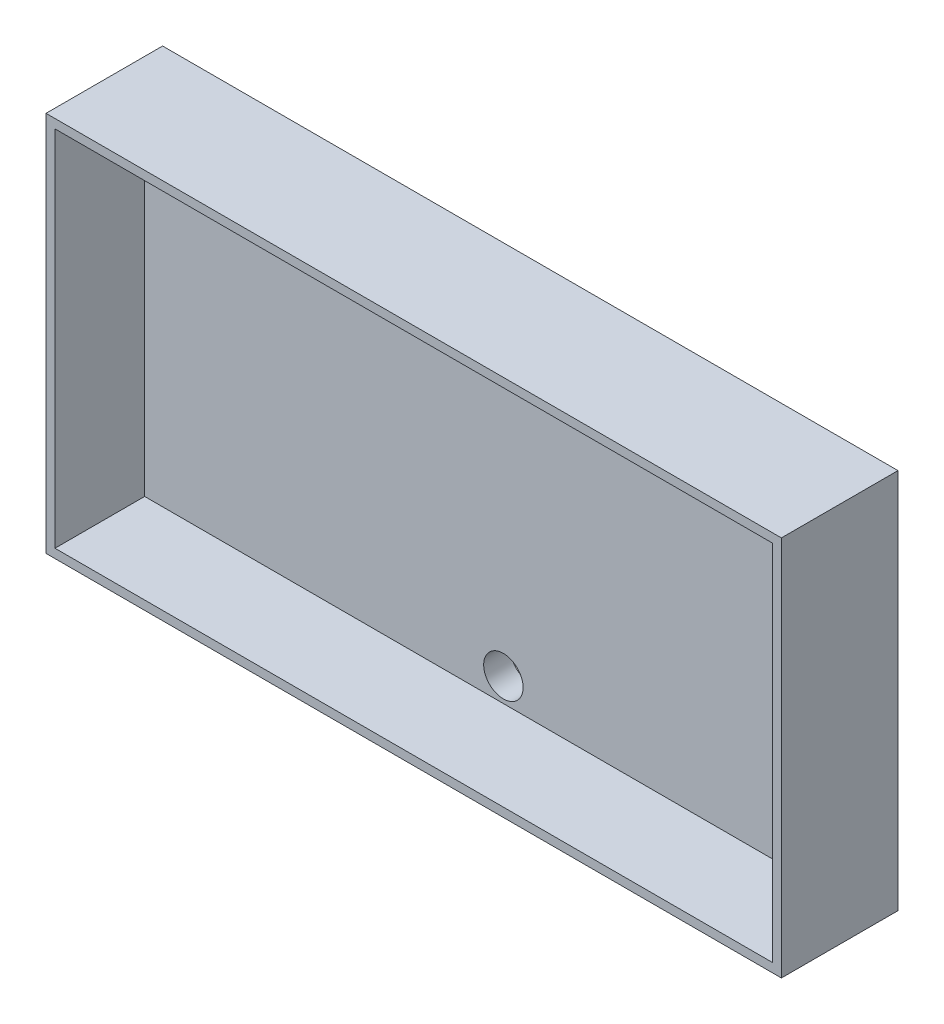
ISO-10303-21;
HEADER;
FILE_DESCRIPTION(('STEP AP214'),'2;1');
FILE_NAME('part.step','',(''),(''),'','','');
FILE_SCHEMA(('AUTOMOTIVE_DESIGN { 1 0 10303 214 1 1 1 1 }'));
ENDSEC;
DATA;
#1=APPLICATION_CONTEXT('core data for automotive mechanical design processes');
#2=APPLICATION_PROTOCOL_DEFINITION('international standard','automotive_design',2000,#1);
#3=PRODUCT_CONTEXT('',#1,'mechanical');
#4=PRODUCT('Part','Part','',(#3));
#5=PRODUCT_RELATED_PRODUCT_CATEGORY('part','',(#4));
#6=PRODUCT_DEFINITION_FORMATION('','',#4);
#7=PRODUCT_DEFINITION_CONTEXT('part definition',#1,'design');
#8=PRODUCT_DEFINITION('design','',#6,#7);
#9=PRODUCT_DEFINITION_SHAPE('','',#8);
#10=(LENGTH_UNIT() NAMED_UNIT(*) SI_UNIT(.MILLI.,.METRE.));
#11=(NAMED_UNIT(*) PLANE_ANGLE_UNIT() SI_UNIT($,.RADIAN.));
#12=(NAMED_UNIT(*) SI_UNIT($,.STERADIAN.) SOLID_ANGLE_UNIT());
#13=UNCERTAINTY_MEASURE_WITH_UNIT(LENGTH_MEASURE(1.E-05),#10,'distance_accuracy_value','');
#14=(GEOMETRIC_REPRESENTATION_CONTEXT(3) GLOBAL_UNCERTAINTY_ASSIGNED_CONTEXT((#13)) GLOBAL_UNIT_ASSIGNED_CONTEXT((#10,
#11,#12)) REPRESENTATION_CONTEXT('',''));
#15=CARTESIAN_POINT('',(0.,0.,0.));
#16=DIRECTION('',(0.,0.,1.));
#17=DIRECTION('',(1.,0.,0.));
#18=AXIS2_PLACEMENT_3D('',#15,#16,#17);
#19=CARTESIAN_POINT('',(0.,0.,10.));
#20=DIRECTION('',(0.,0.,1.));
#21=DIRECTION('',(1.,0.,0.));
#22=AXIS2_PLACEMENT_3D('',#19,#20,#21);
#23=PLANE('',#22);
#24=DIRECTION('',(0.,-1.,0.));
#25=VECTOR('',#24,1.);
#26=CARTESIAN_POINT('',(-41.,20.25,10.));
#27=LINE('',#26,#25);
#28=CARTESIAN_POINT('',(-41.,21.25,10.));
#29=VERTEX_POINT('',#28);
#30=CARTESIAN_POINT('',(-41.,-21.25,10.));
#31=VERTEX_POINT('',#30);
#32=EDGE_CURVE('E179',#29,#31,#27,.T.);
#33=ORIENTED_EDGE('',*,*,#32,.T.);
#34=DIRECTION('',(1.,0.,0.));
#35=VECTOR('',#34,1.);
#36=CARTESIAN_POINT('',(-40.,-21.25,10.));
#37=LINE('',#36,#35);
#38=CARTESIAN_POINT('',(41.,-21.25,10.));
#39=VERTEX_POINT('',#38);
#40=EDGE_CURVE('E126',#31,#39,#37,.T.);
#41=ORIENTED_EDGE('',*,*,#40,.T.);
#42=DIRECTION('',(0.,1.,0.));
#43=VECTOR('',#42,1.);
#44=CARTESIAN_POINT('',(41.,20.25,10.));
#45=LINE('',#44,#43);
#46=CARTESIAN_POINT('',(41.,21.25,10.));
#47=VERTEX_POINT('',#46);
#48=EDGE_CURVE('E182',#39,#47,#45,.T.);
#49=ORIENTED_EDGE('',*,*,#48,.T.);
#50=DIRECTION('',(-1.,0.,0.));
#51=VECTOR('',#50,1.);
#52=CARTESIAN_POINT('',(-40.,21.25,10.));
#53=LINE('',#52,#51);
#54=EDGE_CURVE('E80',#47,#29,#53,.T.);
#55=ORIENTED_EDGE('',*,*,#54,.T.);
#56=EDGE_LOOP('',(#33,#41,#49,#55));
#57=FACE_BOUND('',#56,.T.);
#58=DIRECTION('',(1.,0.,0.));
#59=VECTOR('',#58,1.);
#60=CARTESIAN_POINT('',(-40.,-20.25,10.));
#61=LINE('',#60,#59);
#62=CARTESIAN_POINT('',(-40.,-20.25,10.));
#63=VERTEX_POINT('',#62);
#64=CARTESIAN_POINT('',(40.,-20.25,10.));
#65=VERTEX_POINT('',#64);
#66=EDGE_CURVE('E154',#63,#65,#61,.T.);
#67=ORIENTED_EDGE('',*,*,#66,.F.);
#68=DIRECTION('',(0.,-1.,0.));
#69=VECTOR('',#68,1.);
#70=CARTESIAN_POINT('',(-40.,20.25,10.));
#71=LINE('',#70,#69);
#72=CARTESIAN_POINT('',(-40.,20.25,10.));
#73=VERTEX_POINT('',#72);
#74=EDGE_CURVE('E152',#73,#63,#71,.T.);
#75=ORIENTED_EDGE('',*,*,#74,.F.);
#76=DIRECTION('',(-1.,0.,0.));
#77=VECTOR('',#76,1.);
#78=CARTESIAN_POINT('',(-40.,20.25,10.));
#79=LINE('',#78,#77);
#80=CARTESIAN_POINT('',(40.,20.25,10.));
#81=VERTEX_POINT('',#80);
#82=EDGE_CURVE('E159',#81,#73,#79,.T.);
#83=ORIENTED_EDGE('',*,*,#82,.F.);
#84=DIRECTION('',(0.,1.,0.));
#85=VECTOR('',#84,1.);
#86=CARTESIAN_POINT('',(40.,20.25,10.));
#87=LINE('',#86,#85);
#88=EDGE_CURVE('E157',#65,#81,#87,.T.);
#89=ORIENTED_EDGE('',*,*,#88,.F.);
#90=EDGE_LOOP('',(#67,#75,#83,#89));
#91=FACE_BOUND('',#90,.T.);
#92=ADVANCED_FACE('F57',(#57,#91),#23,.T.);
#93=CARTESIAN_POINT('',(-41.,20.25,10.));
#94=DIRECTION('',(1.,0.,0.));
#95=DIRECTION('',(0.,0.,-1.));
#96=AXIS2_PLACEMENT_3D('',#93,#94,#95);
#97=PLANE('',#96);
#98=DIRECTION('',(0.,0.,-1.));
#99=VECTOR('',#98,1.);
#100=CARTESIAN_POINT('',(-41.,21.25,10.));
#101=LINE('',#100,#99);
#102=CARTESIAN_POINT('',(-41.,21.25,-3.));
#103=VERTEX_POINT('',#102);
#104=EDGE_CURVE('E140',#29,#103,#101,.T.);
#105=ORIENTED_EDGE('',*,*,#104,.T.);
#106=DIRECTION('',(0.,-1.,0.));
#107=VECTOR('',#106,1.);
#108=CARTESIAN_POINT('',(-41.,21.25,-3.));
#109=LINE('',#108,#107);
#110=CARTESIAN_POINT('',(-41.,-21.25,-3.));
#111=VERTEX_POINT('',#110);
#112=EDGE_CURVE('E135',#103,#111,#109,.T.);
#113=ORIENTED_EDGE('',*,*,#112,.T.);
#114=DIRECTION('',(0.,0.,-1.));
#115=VECTOR('',#114,1.);
#116=CARTESIAN_POINT('',(-41.,-21.25,10.));
#117=LINE('',#116,#115);
#118=EDGE_CURVE('E12',#31,#111,#117,.T.);
#119=ORIENTED_EDGE('',*,*,#118,.F.);
#120=ORIENTED_EDGE('',*,*,#32,.F.);
#121=EDGE_LOOP('',(#105,#113,#119,#120));
#122=FACE_BOUND('',#121,.T.);
#123=ADVANCED_FACE('F59',(#122),#97,.F.);
#124=CARTESIAN_POINT('',(-40.,-21.25,10.));
#125=DIRECTION('',(0.,1.,0.));
#126=DIRECTION('',(0.,0.,1.));
#127=AXIS2_PLACEMENT_3D('',#124,#125,#126);
#128=PLANE('',#127);
#129=ORIENTED_EDGE('',*,*,#118,.T.);
#130=DIRECTION('',(1.,0.,0.));
#131=VECTOR('',#130,1.);
#132=CARTESIAN_POINT('',(-41.,-21.25,-3.));
#133=LINE('',#132,#131);
#134=CARTESIAN_POINT('',(41.,-21.25,-3.));
#135=VERTEX_POINT('',#134);
#136=EDGE_CURVE('E125',#111,#135,#133,.T.);
#137=ORIENTED_EDGE('',*,*,#136,.T.);
#138=DIRECTION('',(0.,0.,-1.));
#139=VECTOR('',#138,1.);
#140=CARTESIAN_POINT('',(41.,-21.25,10.));
#141=LINE('',#140,#139);
#142=EDGE_CURVE('E65',#39,#135,#141,.T.);
#143=ORIENTED_EDGE('',*,*,#142,.F.);
#144=ORIENTED_EDGE('',*,*,#40,.F.);
#145=EDGE_LOOP('',(#129,#137,#143,#144));
#146=FACE_BOUND('',#145,.T.);
#147=ADVANCED_FACE('F123',(#146),#128,.F.);
#148=CARTESIAN_POINT('',(41.,20.25,10.));
#149=DIRECTION('',(-1.,0.,0.));
#150=DIRECTION('',(0.,0.,1.));
#151=AXIS2_PLACEMENT_3D('',#148,#149,#150);
#152=PLANE('',#151);
#153=ORIENTED_EDGE('',*,*,#142,.T.);
#154=DIRECTION('',(0.,1.,0.));
#155=VECTOR('',#154,1.);
#156=CARTESIAN_POINT('',(41.,-21.25,-3.));
#157=LINE('',#156,#155);
#158=CARTESIAN_POINT('',(41.,21.25,-3.));
#159=VERTEX_POINT('',#158);
#160=EDGE_CURVE('E138',#135,#159,#157,.T.);
#161=ORIENTED_EDGE('',*,*,#160,.T.);
#162=DIRECTION('',(0.,0.,-1.));
#163=VECTOR('',#162,1.);
#164=CARTESIAN_POINT('',(41.,21.25,10.));
#165=LINE('',#164,#163);
#166=EDGE_CURVE('E186',#47,#159,#165,.T.);
#167=ORIENTED_EDGE('',*,*,#166,.F.);
#168=ORIENTED_EDGE('',*,*,#48,.F.);
#169=EDGE_LOOP('',(#153,#161,#167,#168));
#170=FACE_BOUND('',#169,.T.);
#171=ADVANCED_FACE('F189',(#170),#152,.F.);
#172=CARTESIAN_POINT('',(-40.,21.25,10.));
#173=DIRECTION('',(0.,-1.,0.));
#174=DIRECTION('',(1.,0.,0.));
#175=AXIS2_PLACEMENT_3D('',#172,#173,#174);
#176=PLANE('',#175);
#177=ORIENTED_EDGE('',*,*,#166,.T.);
#178=DIRECTION('',(-1.,0.,0.));
#179=VECTOR('',#178,1.);
#180=CARTESIAN_POINT('',(41.,21.25,-3.));
#181=LINE('',#180,#179);
#182=EDGE_CURVE('E149',#159,#103,#181,.T.);
#183=ORIENTED_EDGE('',*,*,#182,.T.);
#184=ORIENTED_EDGE('',*,*,#104,.F.);
#185=ORIENTED_EDGE('',*,*,#54,.F.);
#186=EDGE_LOOP('',(#177,#183,#184,#185));
#187=FACE_BOUND('',#186,.T.);
#188=ADVANCED_FACE('F226',(#187),#176,.F.);
#189=CARTESIAN_POINT('',(-40.,20.25,10.));
#190=DIRECTION('',(1.,0.,0.));
#191=DIRECTION('',(0.,0.,-1.));
#192=AXIS2_PLACEMENT_3D('',#189,#190,#191);
#193=PLANE('',#192);
#194=DIRECTION('',(0.,-1.,0.));
#195=VECTOR('',#194,1.);
#196=CARTESIAN_POINT('',(-40.,20.25,0.));
#197=LINE('',#196,#195);
#198=CARTESIAN_POINT('',(-40.,20.25,0.));
#199=VERTEX_POINT('',#198);
#200=CARTESIAN_POINT('',(-40.,-20.25,0.));
#201=VERTEX_POINT('',#200);
#202=EDGE_CURVE('E151',#199,#201,#197,.T.);
#203=ORIENTED_EDGE('',*,*,#202,.F.);
#204=DIRECTION('',(0.,0.,-1.));
#205=VECTOR('',#204,1.);
#206=CARTESIAN_POINT('',(-40.,20.25,10.));
#207=LINE('',#206,#205);
#208=EDGE_CURVE('E161',#73,#199,#207,.T.);
#209=ORIENTED_EDGE('',*,*,#208,.F.);
#210=ORIENTED_EDGE('',*,*,#74,.T.);
#211=DIRECTION('',(0.,0.,-1.));
#212=VECTOR('',#211,1.);
#213=CARTESIAN_POINT('',(-40.,-20.25,10.));
#214=LINE('',#213,#212);
#215=EDGE_CURVE('E176',#63,#201,#214,.T.);
#216=ORIENTED_EDGE('',*,*,#215,.T.);
#217=EDGE_LOOP('',(#203,#209,#210,#216));
#218=FACE_BOUND('',#217,.T.);
#219=ADVANCED_FACE('F209',(#218),#193,.T.);
#220=CARTESIAN_POINT('',(-40.,-20.25,10.));
#221=DIRECTION('',(0.,1.,0.));
#222=DIRECTION('',(0.,0.,1.));
#223=AXIS2_PLACEMENT_3D('',#220,#221,#222);
#224=PLANE('',#223);
#225=DIRECTION('',(1.,0.,0.));
#226=VECTOR('',#225,1.);
#227=CARTESIAN_POINT('',(-40.,-20.25,0.));
#228=LINE('',#227,#226);
#229=CARTESIAN_POINT('',(40.,-20.25,0.));
#230=VERTEX_POINT('',#229);
#231=EDGE_CURVE('E164',#201,#230,#228,.T.);
#232=ORIENTED_EDGE('',*,*,#231,.F.);
#233=ORIENTED_EDGE('',*,*,#215,.F.);
#234=ORIENTED_EDGE('',*,*,#66,.T.);
#235=DIRECTION('',(0.,0.,-1.));
#236=VECTOR('',#235,1.);
#237=CARTESIAN_POINT('',(40.,-20.25,10.));
#238=LINE('',#237,#236);
#239=EDGE_CURVE('E174',#65,#230,#238,.T.);
#240=ORIENTED_EDGE('',*,*,#239,.T.);
#241=EDGE_LOOP('',(#232,#233,#234,#240));
#242=FACE_BOUND('',#241,.T.);
#243=ADVANCED_FACE('F201',(#242),#224,.T.);
#244=CARTESIAN_POINT('',(40.,20.25,10.));
#245=DIRECTION('',(-1.,0.,0.));
#246=DIRECTION('',(0.,0.,1.));
#247=AXIS2_PLACEMENT_3D('',#244,#245,#246);
#248=PLANE('',#247);
#249=DIRECTION('',(0.,1.,0.));
#250=VECTOR('',#249,1.);
#251=CARTESIAN_POINT('',(40.,20.25,0.));
#252=LINE('',#251,#250);
#253=CARTESIAN_POINT('',(40.,20.25,0.));
#254=VERTEX_POINT('',#253);
#255=EDGE_CURVE('E167',#230,#254,#252,.T.);
#256=ORIENTED_EDGE('',*,*,#255,.F.);
#257=ORIENTED_EDGE('',*,*,#239,.F.);
#258=ORIENTED_EDGE('',*,*,#88,.T.);
#259=DIRECTION('',(0.,0.,-1.));
#260=VECTOR('',#259,1.);
#261=CARTESIAN_POINT('',(40.,20.25,10.));
#262=LINE('',#261,#260);
#263=EDGE_CURVE('E72',#81,#254,#262,.T.);
#264=ORIENTED_EDGE('',*,*,#263,.T.);
#265=EDGE_LOOP('',(#256,#257,#258,#264));
#266=FACE_BOUND('',#265,.T.);
#267=ADVANCED_FACE('F204',(#266),#248,.T.);
#268=CARTESIAN_POINT('',(-40.,20.25,10.));
#269=DIRECTION('',(0.,-1.,0.));
#270=DIRECTION('',(1.,0.,0.));
#271=AXIS2_PLACEMENT_3D('',#268,#269,#270);
#272=PLANE('',#271);
#273=DIRECTION('',(-1.,0.,0.));
#274=VECTOR('',#273,1.);
#275=CARTESIAN_POINT('',(-40.,20.25,0.));
#276=LINE('',#275,#274);
#277=EDGE_CURVE('E155',#254,#199,#276,.T.);
#278=ORIENTED_EDGE('',*,*,#277,.F.);
#279=ORIENTED_EDGE('',*,*,#263,.F.);
#280=ORIENTED_EDGE('',*,*,#82,.T.);
#281=ORIENTED_EDGE('',*,*,#208,.T.);
#282=EDGE_LOOP('',(#278,#279,#280,#281));
#283=FACE_BOUND('',#282,.T.);
#284=ADVANCED_FACE('F211',(#283),#272,.T.);
#285=CARTESIAN_POINT('',(0.,0.,0.));
#286=DIRECTION('',(0.,0.,1.));
#287=DIRECTION('',(1.,0.,0.));
#288=AXIS2_PLACEMENT_3D('',#285,#286,#287);
#289=PLANE('',#288);
#290=CARTESIAN_POINT('',(0.,-17.6,0.));
#291=DIRECTION('',(0.,0.,1.));
#292=DIRECTION('',(1.,0.,0.));
#293=AXIS2_PLACEMENT_3D('',#290,#291,#292);
#294=CIRCLE('',#293,2.2);
#295=CARTESIAN_POINT('',(2.2,-17.6,0.));
#296=VERTEX_POINT('',#295);
#297=EDGE_CURVE('E141',#296,#296,#294,.T.);
#298=ORIENTED_EDGE('',*,*,#297,.F.);
#299=EDGE_LOOP('',(#298));
#300=FACE_BOUND('',#299,.T.);
#301=CARTESIAN_POINT('',(0.,17.6,0.));
#302=DIRECTION('',(0.,0.,1.));
#303=DIRECTION('',(1.,0.,0.));
#304=AXIS2_PLACEMENT_3D('',#301,#302,#303);
#305=CIRCLE('',#304,2.2);
#306=CARTESIAN_POINT('',(2.2,17.6,0.));
#307=VERTEX_POINT('',#306);
#308=EDGE_CURVE('E144',#307,#307,#305,.T.);
#309=ORIENTED_EDGE('',*,*,#308,.F.);
#310=EDGE_LOOP('',(#309));
#311=FACE_BOUND('',#310,.T.);
#312=ORIENTED_EDGE('',*,*,#277,.T.);
#313=ORIENTED_EDGE('',*,*,#202,.T.);
#314=ORIENTED_EDGE('',*,*,#231,.T.);
#315=ORIENTED_EDGE('',*,*,#255,.T.);
#316=EDGE_LOOP('',(#312,#313,#314,#315));
#317=FACE_BOUND('',#316,.T.);
#318=ADVANCED_FACE('F206',(#300,#311,#317),#289,.T.);
#319=CARTESIAN_POINT('',(0.,0.,-3.));
#320=DIRECTION('',(0.,0.,1.));
#321=DIRECTION('',(1.,0.,0.));
#322=AXIS2_PLACEMENT_3D('',#319,#320,#321);
#323=PLANE('',#322);
#324=CARTESIAN_POINT('',(0.,-17.6,-3.));
#325=DIRECTION('',(0.,0.,1.));
#326=DIRECTION('',(1.,0.,0.));
#327=AXIS2_PLACEMENT_3D('',#324,#325,#326);
#328=CIRCLE('',#327,2.2);
#329=CARTESIAN_POINT('',(2.2,-17.6,-3.));
#330=VERTEX_POINT('',#329);
#331=EDGE_CURVE('E328',#330,#330,#328,.T.);
#332=ORIENTED_EDGE('',*,*,#331,.T.);
#333=EDGE_LOOP('',(#332));
#334=FACE_BOUND('',#333,.T.);
#335=CARTESIAN_POINT('',(0.,17.6,-3.));
#336=DIRECTION('',(0.,0.,1.));
#337=DIRECTION('',(1.,0.,0.));
#338=AXIS2_PLACEMENT_3D('',#335,#336,#337);
#339=CIRCLE('',#338,2.2);
#340=CARTESIAN_POINT('',(2.2,17.6,-3.));
#341=VERTEX_POINT('',#340);
#342=EDGE_CURVE('E329',#341,#341,#339,.T.);
#343=ORIENTED_EDGE('',*,*,#342,.T.);
#344=EDGE_LOOP('',(#343));
#345=FACE_BOUND('',#344,.T.);
#346=ORIENTED_EDGE('',*,*,#112,.F.);
#347=ORIENTED_EDGE('',*,*,#182,.F.);
#348=ORIENTED_EDGE('',*,*,#160,.F.);
#349=ORIENTED_EDGE('',*,*,#136,.F.);
#350=EDGE_LOOP('',(#346,#347,#348,#349));
#351=FACE_BOUND('',#350,.T.);
#352=ADVANCED_FACE('F133',(#334,#345,#351),#323,.F.);
#353=CARTESIAN_POINT('',(0.,17.6,-3.));
#354=DIRECTION('',(0.,0.,1.));
#355=DIRECTION('',(1.,0.,0.));
#356=AXIS2_PLACEMENT_3D('',#353,#354,#355);
#357=CYLINDRICAL_SURFACE('',#356,2.2);
#358=ORIENTED_EDGE('',*,*,#308,.T.);
#359=EDGE_LOOP('',(#358));
#360=FACE_BOUND('',#359,.T.);
#361=ORIENTED_EDGE('',*,*,#342,.F.);
#362=EDGE_LOOP('',(#361));
#363=FACE_BOUND('',#362,.T.);
#364=ADVANCED_FACE('F301',(#360,#363),#357,.F.);
#365=CARTESIAN_POINT('',(0.,-17.6,-3.));
#366=DIRECTION('',(0.,0.,1.));
#367=DIRECTION('',(1.,0.,0.));
#368=AXIS2_PLACEMENT_3D('',#365,#366,#367);
#369=CYLINDRICAL_SURFACE('',#368,2.2);
#370=ORIENTED_EDGE('',*,*,#297,.T.);
#371=EDGE_LOOP('',(#370));
#372=FACE_BOUND('',#371,.T.);
#373=ORIENTED_EDGE('',*,*,#331,.F.);
#374=EDGE_LOOP('',(#373));
#375=FACE_BOUND('',#374,.T.);
#376=ADVANCED_FACE('F310',(#372,#375),#369,.F.);
#377=CLOSED_SHELL('',(#92,#123,#147,#171,#188,#219,#243,#267,#284,#318,#352,#364,#376));
#378=MANIFOLD_SOLID_BREP('B2',#377);
#379=ADVANCED_BREP_SHAPE_REPRESENTATION('',(#18,#378),#14);
#380=SHAPE_DEFINITION_REPRESENTATION(#9,#379);
ENDSEC;
END-ISO-10303-21;
